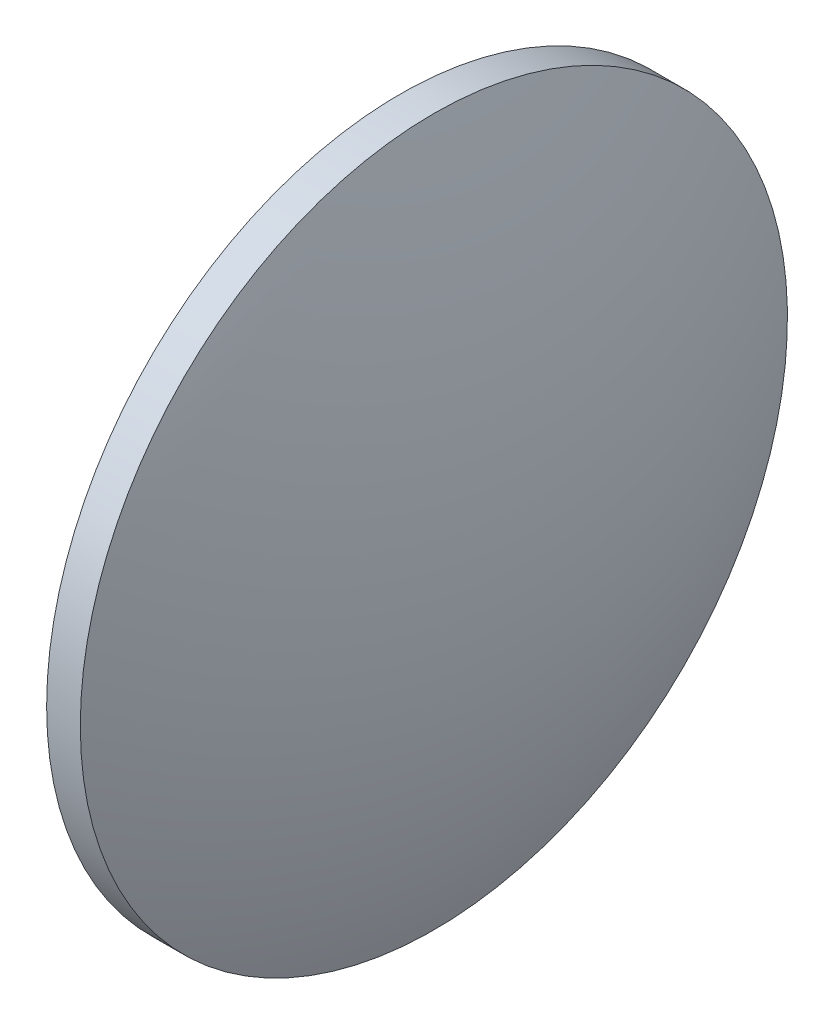
ISO-10303-21;
HEADER;
FILE_DESCRIPTION(('STEP AP214'),'2;1');
FILE_NAME('part.step','',(''),(''),'','','');
FILE_SCHEMA(('AUTOMOTIVE_DESIGN { 1 0 10303 214 1 1 1 1 }'));
ENDSEC;
DATA;
#1=APPLICATION_CONTEXT('core data for automotive mechanical design processes');
#2=APPLICATION_PROTOCOL_DEFINITION('international standard','automotive_design',2000,#1);
#3=PRODUCT_CONTEXT('',#1,'mechanical');
#4=PRODUCT('Part','Part','',(#3));
#5=PRODUCT_RELATED_PRODUCT_CATEGORY('part','',(#4));
#6=PRODUCT_DEFINITION_FORMATION('','',#4);
#7=PRODUCT_DEFINITION_CONTEXT('part definition',#1,'design');
#8=PRODUCT_DEFINITION('design','',#6,#7);
#9=PRODUCT_DEFINITION_SHAPE('','',#8);
#10=(LENGTH_UNIT() NAMED_UNIT(*) SI_UNIT(.MILLI.,.METRE.));
#11=(NAMED_UNIT(*) PLANE_ANGLE_UNIT() SI_UNIT($,.RADIAN.));
#12=(NAMED_UNIT(*) SI_UNIT($,.STERADIAN.) SOLID_ANGLE_UNIT());
#13=UNCERTAINTY_MEASURE_WITH_UNIT(LENGTH_MEASURE(1.E-05),#10,'distance_accuracy_value','');
#14=(GEOMETRIC_REPRESENTATION_CONTEXT(3) GLOBAL_UNCERTAINTY_ASSIGNED_CONTEXT((#13)) GLOBAL_UNIT_ASSIGNED_CONTEXT((#10,
#11,#12)) REPRESENTATION_CONTEXT('',''));
#15=CARTESIAN_POINT('',(0.,0.,0.));
#16=DIRECTION('',(0.,0.,1.));
#17=DIRECTION('',(1.,0.,0.));
#18=AXIS2_PLACEMENT_3D('',#15,#16,#17);
#19=CARTESIAN_POINT('',(379.223805664849,80.8213210864702,0.));
#20=DIRECTION('',(-1.,0.,0.));
#21=DIRECTION('',(0.,1.,0.));
#22=AXIS2_PLACEMENT_3D('',#19,#20,#21);
#23=SPHERICAL_SURFACE('',#22,82.6272115384614);
#24=CARTESIAN_POINT('',(455.61101720331,80.8213210864702,0.));
#25=DIRECTION('',(-1.,0.,0.));
#26=DIRECTION('',(0.,0.,1.));
#27=AXIS2_PLACEMENT_3D('',#24,#25,#26);
#28=CIRCLE('',#27,31.5);
#29=CARTESIAN_POINT('',(455.61101720331,80.8213210864702,31.5));
#30=VERTEX_POINT('',#29);
#31=EDGE_CURVE('E10',#30,#30,#28,.T.);
#32=ORIENTED_EDGE('',*,*,#31,.F.);
#33=EDGE_LOOP('',(#32));
#34=FACE_BOUND('',#33,.T.);
#35=ADVANCED_FACE('F35',(#34),#23,.T.);
#36=CARTESIAN_POINT('',(444.64028553598,80.8213210864702,0.));
#37=DIRECTION('',(-1.,0.,0.));
#38=DIRECTION('',(0.,0.,1.));
#39=AXIS2_PLACEMENT_3D('',#36,#37,#38);
#40=CYLINDRICAL_SURFACE('',#39,31.5);
#41=CARTESIAN_POINT('',(452.61101720331,80.8213210864702,0.));
#42=DIRECTION('',(-1.,0.,0.));
#43=DIRECTION('',(0.,0.,1.));
#44=AXIS2_PLACEMENT_3D('',#41,#42,#43);
#45=CIRCLE('',#44,31.5);
#46=CARTESIAN_POINT('',(452.61101720331,80.8213210864702,31.5));
#47=VERTEX_POINT('',#46);
#48=EDGE_CURVE('E41',#47,#47,#45,.T.);
#49=ORIENTED_EDGE('',*,*,#48,.F.);
#50=EDGE_LOOP('',(#49));
#51=FACE_BOUND('',#50,.T.);
#52=ORIENTED_EDGE('',*,*,#31,.T.);
#53=EDGE_LOOP('',(#52));
#54=FACE_BOUND('',#53,.T.);
#55=ADVANCED_FACE('F49',(#51,#54),#40,.T.);
#56=CARTESIAN_POINT('',(452.61101720331,80.8213210864702,0.));
#57=DIRECTION('',(1.,0.,0.));
#58=DIRECTION('',(0.,0.,-1.));
#59=AXIS2_PLACEMENT_3D('',#56,#57,#58);
#60=PLANE('',#59);
#61=ORIENTED_EDGE('',*,*,#48,.T.);
#62=EDGE_LOOP('',(#61));
#63=FACE_BOUND('',#62,.T.);
#64=ADVANCED_FACE('F47',(#63),#60,.F.);
#65=CLOSED_SHELL('',(#35,#55,#64));
#66=MANIFOLD_SOLID_BREP('B2',#65);
#67=ADVANCED_BREP_SHAPE_REPRESENTATION('',(#18,#66),#14);
#68=SHAPE_DEFINITION_REPRESENTATION(#9,#67);
ENDSEC;
END-ISO-10303-21;
